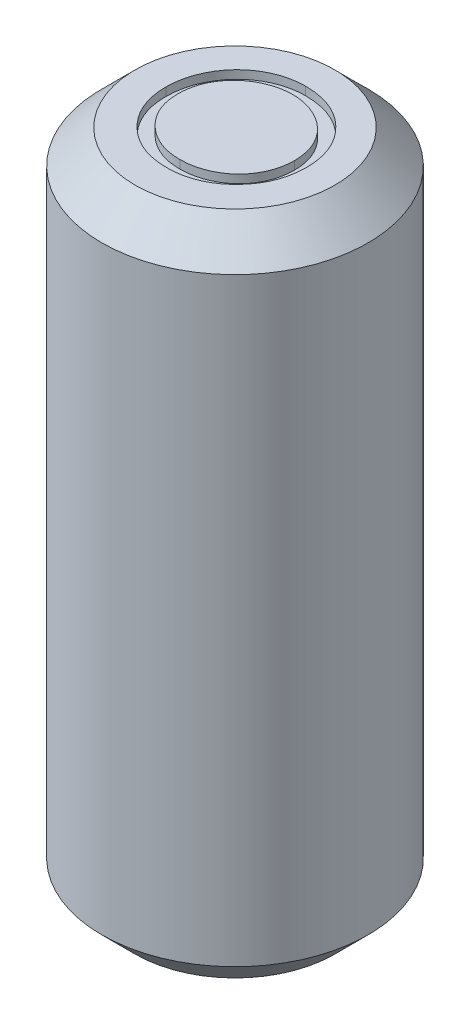
ISO-10303-21;
HEADER;
FILE_DESCRIPTION(('STEP AP214'),'2;1');
FILE_NAME('part.step','',(''),(''),'','','');
FILE_SCHEMA(('AUTOMOTIVE_DESIGN { 1 0 10303 214 1 1 1 1 }'));
ENDSEC;
DATA;
#1=APPLICATION_CONTEXT('core data for automotive mechanical design processes');
#2=APPLICATION_PROTOCOL_DEFINITION('international standard','automotive_design',2000,#1);
#3=PRODUCT_CONTEXT('',#1,'mechanical');
#4=PRODUCT('Part','Part','',(#3));
#5=PRODUCT_RELATED_PRODUCT_CATEGORY('part','',(#4));
#6=PRODUCT_DEFINITION_FORMATION('','',#4);
#7=PRODUCT_DEFINITION_CONTEXT('part definition',#1,'design');
#8=PRODUCT_DEFINITION('design','',#6,#7);
#9=PRODUCT_DEFINITION_SHAPE('','',#8);
#10=(LENGTH_UNIT() NAMED_UNIT(*) SI_UNIT(.MILLI.,.METRE.));
#11=(NAMED_UNIT(*) PLANE_ANGLE_UNIT() SI_UNIT($,.RADIAN.));
#12=(NAMED_UNIT(*) SI_UNIT($,.STERADIAN.) SOLID_ANGLE_UNIT());
#13=UNCERTAINTY_MEASURE_WITH_UNIT(LENGTH_MEASURE(1.E-05),#10,'distance_accuracy_value','');
#14=(GEOMETRIC_REPRESENTATION_CONTEXT(3) GLOBAL_UNCERTAINTY_ASSIGNED_CONTEXT((#13)) GLOBAL_UNIT_ASSIGNED_CONTEXT((#10,
#11,#12)) REPRESENTATION_CONTEXT('',''));
#15=CARTESIAN_POINT('',(0.,0.,0.));
#16=DIRECTION('',(0.,0.,1.));
#17=DIRECTION('',(1.,0.,0.));
#18=AXIS2_PLACEMENT_3D('',#15,#16,#17);
#19=CARTESIAN_POINT('',(0.,20.,0.));
#20=DIRECTION('',(0.,1.,0.));
#21=DIRECTION('',(0.,0.,1.));
#22=AXIS2_PLACEMENT_3D('',#19,#20,#21);
#23=PLANE('',#22);
#24=CARTESIAN_POINT('',(0.,20.,0.));
#25=DIRECTION('',(0.,1.,0.));
#26=DIRECTION('',(0.,0.,1.));
#27=AXIS2_PLACEMENT_3D('',#24,#25,#26);
#28=CIRCLE('',#27,3.);
#29=CARTESIAN_POINT('',(0.,20.,3.));
#30=VERTEX_POINT('',#29);
#31=EDGE_CURVE('E11',#30,#30,#28,.T.);
#32=ORIENTED_EDGE('',*,*,#31,.T.);
#33=EDGE_LOOP('',(#32));
#34=FACE_BOUND('',#33,.T.);
#35=CARTESIAN_POINT('',(0.01653255673133,20.,2.07047889890283));
#36=CARTESIAN_POINT('',(-0.0559523792453316,20.,2.06870817106936));
#37=CARTESIAN_POINT('',(-0.198839483174882,20.,2.06521759515088));
#38=CARTESIAN_POINT('',(-0.408596095037471,20.,2.03529598966283));
#39=CARTESIAN_POINT('',(-0.610056373720643,20.,1.98850592817573));
#40=CARTESIAN_POINT('',(-0.802644203677615,20.,1.92163800106882));
#41=CARTESIAN_POINT('',(-0.986466980361596,20.,1.83521830881186));
#42=CARTESIAN_POINT('',(-1.1618842177268,20.,1.7298418755947));
#43=CARTESIAN_POINT('',(-1.3281918145744,20.,1.60480514281684));
#44=CARTESIAN_POINT('',(-1.48401095341386,20.,1.46290048615286));
#45=CARTESIAN_POINT('',(-1.62658146562237,20.,1.30841871242052));
#46=CARTESIAN_POINT('',(-1.75087789498567,20.,1.14289384947401));
#47=CARTESIAN_POINT('',(-1.85627802449332,20.,0.969573327595772));
#48=CARTESIAN_POINT('',(-1.94240754734506,20.,0.787976157181266));
#49=CARTESIAN_POINT('',(-2.01059550088187,20.,0.598980222664964));
#50=CARTESIAN_POINT('',(-2.05711529304082,20.,0.401324819819868));
#51=CARTESIAN_POINT('',(-2.08721352397665,20.,0.196136813174394));
#52=CARTESIAN_POINT('',(-2.09068191995576,20.,0.056430643659763));
#53=CARTESIAN_POINT('',(-2.09244180224303,20.,-0.0144569985330626));
#54=B_SPLINE_CURVE_WITH_KNOTS('',3,(#35,#36,#37,#38,#39,#40,#41,#42,#43,#44,#45,#46,#47,#48,#49,
#50,#51,#52,#53),.UNSPECIFIED.,.F.,.F.,(4,1,1,1,1,1,1,1,1,1,1,1,1,1,1,1,4),(0.,
0.065818876843307,0.129746526906831,0.192071954488006,0.253459424298202,0.31456958779642,
0.376279881188026,0.43902565366856,0.503267028829086,0.567492822879295,0.629704795605245,
0.690999649215756,0.751451650917447,0.812004364264694,0.873149681068043,0.935635483731786,1.),.UNSPECIFIED.);
#55=CARTESIAN_POINT('',(0.01653255673133,20.,2.07047889890283));
#56=VERTEX_POINT('',#55);
#57=CARTESIAN_POINT('',(-2.09244180224303,20.,-0.0144569985330626));
#58=VERTEX_POINT('',#57);
#59=EDGE_CURVE('E189',#56,#58,#54,.T.);
#60=ORIENTED_EDGE('',*,*,#59,.T.);
#61=CARTESIAN_POINT('',(-2.09244180224303,20.,-0.0144569985330626));
#62=CARTESIAN_POINT('',(-2.09183079023719,20.,-0.0620371918320963));
#63=CARTESIAN_POINT('',(-2.0906164744156,20.,-0.156597332982512));
#64=CARTESIAN_POINT('',(-2.07599739730837,20.,-0.297016304585179));
#65=CARTESIAN_POINT('',(-2.05478402450069,20.,-0.435177056318892));
#66=CARTESIAN_POINT('',(-2.02438183872995,20.,-0.570686711135252));
#67=CARTESIAN_POINT('',(-1.98461993360253,20.,-0.703213550795025));
#68=CARTESIAN_POINT('',(-1.93770333087079,20.,-0.833671565465134));
#69=CARTESIAN_POINT('',(-1.88040065046221,20.,-0.96073867831704));
#70=CARTESIAN_POINT('',(-1.81562276698924,20.,-1.08501684027262));
#71=CARTESIAN_POINT('',(-1.74332355782029,20.,-1.20456873265694));
#72=CARTESIAN_POINT('',(-1.6634655584466,20.,-1.31757397054394));
#73=CARTESIAN_POINT('',(-1.57885370876903,20.,-1.42498082400937));
#74=CARTESIAN_POINT('',(-1.48609554462269,20.,-1.52400597125399));
#75=CARTESIAN_POINT('',(-1.38824817868501,20.,-1.61753014998534));
#76=CARTESIAN_POINT('',(-1.28372431796018,20.,-1.70411611229417));
#77=CARTESIAN_POINT('',(-1.17316175297097,20.,-1.78454462767307));
#78=CARTESIAN_POINT('',(-1.05608474752459,20.,-1.85702501747929));
#79=CARTESIAN_POINT('',(-0.935378147662237,20.,-1.9225783141831));
#80=CARTESIAN_POINT('',(-0.810947544485812,20.,-1.97883185816338));
#81=CARTESIAN_POINT('',(-0.6844828913365,20.,-2.02711307131828));
#82=CARTESIAN_POINT('',(-0.555391865135941,20.,-2.06624544297203));
#83=CARTESIAN_POINT('',(-0.424017268472697,20.,-2.09713919839147));
#84=CARTESIAN_POINT('',(-0.290072371817983,20.,-2.11817617405872));
#85=CARTESIAN_POINT('',(-0.153663884641482,20.,-2.1328325373587));
#86=CARTESIAN_POINT('',(-0.0617652344129273,20.,-2.13404111106077));
#87=CARTESIAN_POINT('',(-0.0155187253199521,20.,-2.13464930622537));
#88=B_SPLINE_CURVE_WITH_KNOTS('',3,(#61,#62,#63,#64,#65,#66,#67,#68,#69,#70,#71,#72,#73,#74,#75,
#76,#77,#78,#79,#80,#81,#82,#83,#84,#85,#86,#87),.UNSPECIFIED.,.F.,.F.,(4,1,1,1,1,1,1,1,1,1,1,1,
1,1,1,1,1,1,1,1,1,1,1,1,4),(0.,0.0432089861713366,0.0858728716306187,0.128120006696703,
0.170151964454199,0.211917620987861,0.253753002619124,0.296006408855951,0.338443357144784,
0.381015368162034,0.422820479440761,0.464089055794313,0.505125848683686,0.545974970685241,
0.58698521113386,0.628338591634663,0.670083801591206,0.711991602363722,0.753039154863019,
0.794049395311638,0.834885542701582,0.875498312929513,0.916547299830379,0.958003778644961,1.),.UNSPECIFIED.);
#89=CARTESIAN_POINT('',(-0.0155187253199521,20.,-2.13464930622537));
#90=VERTEX_POINT('',#89);
#91=EDGE_CURVE('E48',#58,#90,#88,.T.);
#92=ORIENTED_EDGE('',*,*,#91,.T.);
#93=CARTESIAN_POINT('',(-0.0155187253199521,20.,-2.13464930622537));
#94=CARTESIAN_POINT('',(0.058547681432086,20.,-2.1327733298013));
#95=CARTESIAN_POINT('',(0.204020215096148,20.,-2.12908875732814));
#96=CARTESIAN_POINT('',(0.41782009820927,20.,-2.10088406755058));
#97=CARTESIAN_POINT('',(0.621928778534491,20.,-2.05208933615963));
#98=CARTESIAN_POINT('',(0.818008937165094,20.,-1.98710307046737));
#99=CARTESIAN_POINT('',(1.00371519610132,20.,-1.90041234431791));
#100=CARTESIAN_POINT('',(1.18044535894771,20.,-1.79562931764418));
#101=CARTESIAN_POINT('',(1.34777892903407,20.,-1.67165622192044));
#102=CARTESIAN_POINT('',(1.50346050792369,20.,-1.5294513912329));
#103=CARTESIAN_POINT('',(1.64592559396163,20.,-1.37472744391682));
#104=CARTESIAN_POINT('',(1.7714408925551,20.,-1.20960983240491));
#105=CARTESIAN_POINT('',(1.87663208539134,20.,-1.035096915483));
#106=CARTESIAN_POINT('',(1.96301584215162,20.,-0.851713109035313));
#107=CARTESIAN_POINT('',(2.03078568180171,20.,-0.659873145635723));
#108=CARTESIAN_POINT('',(2.0775503031624,20.,-0.458554285359863));
#109=CARTESIAN_POINT('',(2.10742247476575,20.,-0.249060925277516));
#110=CARTESIAN_POINT('',(2.11091479180284,20.,-0.106173079878947));
#111=CARTESIAN_POINT('',(2.11268640288518,20.,-0.0336877677638322));
#112=B_SPLINE_CURVE_WITH_KNOTS('',3,(#93,#94,#95,#96,#97,#98,#99,#100,#101,#102,#103,#104,#105,
#106,#107,#108,#109,#110,#111),.UNSPECIFIED.,.F.,.F.,(4,1,1,1,1,1,1,1,1,1,1,1,1,1,1,1,4),(0.,
0.0665700352151801,0.130749041482178,0.193412800029504,0.254989398889709,0.3161135558759,
0.377261757908984,0.439400784155553,0.502970589371976,0.566524976360731,0.628231102513309,
0.689090610599863,0.749344668995804,0.810169593372207,0.871609824317044,0.934869184072764,1.),.UNSPECIFIED.);
#113=CARTESIAN_POINT('',(2.11268640288518,20.,-0.0336877677638322));
#114=VERTEX_POINT('',#113);
#115=EDGE_CURVE('E173',#90,#114,#112,.T.);
#116=ORIENTED_EDGE('',*,*,#115,.T.);
#117=CARTESIAN_POINT('',(2.11268640288518,20.,-0.0336877677638322));
#118=CARTESIAN_POINT('',(2.11091505142908,20.,0.0382635995008125));
#119=CARTESIAN_POINT('',(2.10742351249683,20.,0.180088079994498));
#120=CARTESIAN_POINT('',(2.0775163381705,20.,0.388252016189601));
#121=CARTESIAN_POINT('',(2.03061233820019,20.,0.588355669312141));
#122=CARTESIAN_POINT('',(1.96364517684864,20.,0.780064986769198));
#123=CARTESIAN_POINT('',(1.87767320146202,20.,0.963582202500641));
#124=CARTESIAN_POINT('',(1.77178157731237,20.,1.13842443550847));
#125=CARTESIAN_POINT('',(1.64704876503564,20.,1.30464900509238));
#126=CARTESIAN_POINT('',(1.50509807814042,20.,1.46043490820515));
#127=CARTESIAN_POINT('',(1.35035403012436,20.,1.60328916042642));
#128=CARTESIAN_POINT('',(1.1843765823427,20.,1.72776787549347));
#129=CARTESIAN_POINT('',(1.01089850243181,20.,1.83488116074934));
#130=CARTESIAN_POINT('',(0.827687407392546,20.,1.92034821670962));
#131=CARTESIAN_POINT('',(0.637173079590893,20.,1.98865898293256));
#132=CARTESIAN_POINT('',(0.437650424632607,20.,2.03523341725414));
#133=CARTESIAN_POINT('',(0.23005436287216,20.,2.06527575239936));
#134=CARTESIAN_POINT('',(0.0884875013834962,20.,2.06872548492868));
#135=CARTESIAN_POINT('',(0.01653255673133,20.,2.07047889890283));
#136=B_SPLINE_CURVE_WITH_KNOTS('',3,(#117,#118,#119,#120,#121,#122,#123,#124,#125,#126,#127,
#128,#129,#130,#131,#132,#133,#134,#135),.UNSPECIFIED.,.F.,.F.,(4,1,1,1,1,1,1,1,1,1,1,1,1,1,1,1,
4),(0.,0.0652265038922758,0.128568995706729,0.190320378104467,0.251377988624063,
0.312387528333694,0.373788704276724,0.43643115978045,0.500566755309854,0.564686795384744,
0.627135517883514,0.68845540889498,0.749245746463747,0.810155177364678,0.871670925652923,
0.934773496107724,1.),.UNSPECIFIED.);
#137=EDGE_CURVE('E181',#114,#56,#136,.T.);
#138=ORIENTED_EDGE('',*,*,#137,.T.);
#139=EDGE_LOOP('',(#60,#92,#116,#138));
#140=FACE_BOUND('',#139,.T.);
#141=ADVANCED_FACE('F33',(#34,#140),#23,.T.);
#142=CARTESIAN_POINT('',(0.,20.,0.));
#143=DIRECTION('',(0.,-1.,0.));
#144=DIRECTION('',(0.,0.,-1.));
#145=AXIS2_PLACEMENT_3D('',#142,#143,#144);
#146=CYLINDRICAL_SURFACE('',#145,4.);
#147=CARTESIAN_POINT('',(0.,1.,0.));
#148=DIRECTION('',(0.,1.,0.));
#149=DIRECTION('',(0.,0.,1.));
#150=AXIS2_PLACEMENT_3D('',#147,#148,#149);
#151=CIRCLE('',#150,4.);
#152=CARTESIAN_POINT('',(0.,1.,4.));
#153=VERTEX_POINT('',#152);
#154=EDGE_CURVE('E211',#153,#153,#151,.T.);
#155=ORIENTED_EDGE('',*,*,#154,.T.);
#156=EDGE_LOOP('',(#155));
#157=FACE_BOUND('',#156,.T.);
#158=CARTESIAN_POINT('',(0.,19.,0.));
#159=DIRECTION('',(0.,1.,0.));
#160=DIRECTION('',(0.,0.,1.));
#161=AXIS2_PLACEMENT_3D('',#158,#159,#160);
#162=CIRCLE('',#161,4.);
#163=CARTESIAN_POINT('',(0.,19.,4.));
#164=VERTEX_POINT('',#163);
#165=EDGE_CURVE('E208',#164,#164,#162,.F.);
#166=ORIENTED_EDGE('',*,*,#165,.T.);
#167=EDGE_LOOP('',(#166));
#168=FACE_BOUND('',#167,.T.);
#169=ADVANCED_FACE('F223',(#157,#168),#146,.T.);
#170=CARTESIAN_POINT('',(0.,0.,0.));
#171=DIRECTION('',(0.,1.,0.));
#172=DIRECTION('',(0.,0.,1.));
#173=AXIS2_PLACEMENT_3D('',#170,#171,#172);
#174=PLANE('',#173);
#175=CARTESIAN_POINT('',(0.,0.,0.));
#176=DIRECTION('',(0.,1.,0.));
#177=DIRECTION('',(0.,0.,1.));
#178=AXIS2_PLACEMENT_3D('',#175,#176,#177);
#179=CIRCLE('',#178,2.99999999999999);
#180=CARTESIAN_POINT('',(0.,0.,2.99999999999999));
#181=VERTEX_POINT('',#180);
#182=EDGE_CURVE('E41',#181,#181,#179,.F.);
#183=ORIENTED_EDGE('',*,*,#182,.T.);
#184=EDGE_LOOP('',(#183));
#185=FACE_BOUND('',#184,.T.);
#186=ADVANCED_FACE('F216',(#185),#174,.F.);
#187=CARTESIAN_POINT('',(0.,1.,0.));
#188=DIRECTION('',(0.,1.,0.));
#189=DIRECTION('',(0.,0.,1.));
#190=AXIS2_PLACEMENT_3D('',#187,#188,#189);
#191=CONICAL_SURFACE('',#190,4.,0.785398163397452);
#192=ORIENTED_EDGE('',*,*,#182,.F.);
#193=EDGE_LOOP('',(#192));
#194=FACE_BOUND('',#193,.T.);
#195=ORIENTED_EDGE('',*,*,#154,.F.);
#196=EDGE_LOOP('',(#195));
#197=FACE_BOUND('',#196,.T.);
#198=ADVANCED_FACE('F218',(#194,#197),#191,.T.);
#199=CARTESIAN_POINT('',(0.,20.,0.));
#200=DIRECTION('',(0.,-1.,0.));
#201=DIRECTION('',(0.,0.,-1.));
#202=AXIS2_PLACEMENT_3D('',#199,#200,#201);
#203=CONICAL_SURFACE('',#202,3.,0.785398163397447);
#204=ORIENTED_EDGE('',*,*,#165,.F.);
#205=EDGE_LOOP('',(#204));
#206=FACE_BOUND('',#205,.T.);
#207=ORIENTED_EDGE('',*,*,#31,.F.);
#208=EDGE_LOOP('',(#207));
#209=FACE_BOUND('',#208,.T.);
#210=ADVANCED_FACE('F35',(#206,#209),#203,.T.);
#211=CARTESIAN_POINT('',(-2.09244180224303,19.75,-0.0144569985330626));
#212=CARTESIAN_POINT('',(-2.09183079023719,19.75,-0.0620371918320963));
#213=CARTESIAN_POINT('',(-2.0906164744156,19.75,-0.156597332982512));
#214=CARTESIAN_POINT('',(-2.07599739730837,19.75,-0.297016304585179));
#215=CARTESIAN_POINT('',(-2.05478402450069,19.75,-0.435177056318892));
#216=CARTESIAN_POINT('',(-2.02438183872995,19.75,-0.570686711135252));
#217=CARTESIAN_POINT('',(-1.98461993360253,19.75,-0.703213550795025));
#218=CARTESIAN_POINT('',(-1.93770333087079,19.75,-0.833671565465134));
#219=CARTESIAN_POINT('',(-1.88040065046221,19.75,-0.96073867831704));
#220=CARTESIAN_POINT('',(-1.81562276698924,19.75,-1.08501684027262));
#221=CARTESIAN_POINT('',(-1.74332355782029,19.75,-1.20456873265694));
#222=CARTESIAN_POINT('',(-1.6634655584466,19.75,-1.31757397054394));
#223=CARTESIAN_POINT('',(-1.57885370876903,19.75,-1.42498082400937));
#224=CARTESIAN_POINT('',(-1.48609554462269,19.75,-1.52400597125399));
#225=CARTESIAN_POINT('',(-1.38824817868501,19.75,-1.61753014998534));
#226=CARTESIAN_POINT('',(-1.28372431796018,19.75,-1.70411611229417));
#227=CARTESIAN_POINT('',(-1.17316175297097,19.75,-1.78454462767307));
#228=CARTESIAN_POINT('',(-1.05608474752459,19.75,-1.85702501747929));
#229=CARTESIAN_POINT('',(-0.935378147662237,19.75,-1.9225783141831));
#230=CARTESIAN_POINT('',(-0.810947544485812,19.75,-1.97883185816338));
#231=CARTESIAN_POINT('',(-0.6844828913365,19.75,-2.02711307131828));
#232=CARTESIAN_POINT('',(-0.555391865135941,19.75,-2.06624544297203));
#233=CARTESIAN_POINT('',(-0.424017268472697,19.75,-2.09713919839147));
#234=CARTESIAN_POINT('',(-0.290072371817983,19.75,-2.11817617405872));
#235=CARTESIAN_POINT('',(-0.153663884641482,19.75,-2.1328325373587));
#236=CARTESIAN_POINT('',(-0.0617652344129273,19.75,-2.13404111106077));
#237=CARTESIAN_POINT('',(-0.0155187253199521,19.75,-2.13464930622537));
#238=B_SPLINE_CURVE_WITH_KNOTS('',3,(#211,#212,#213,#214,#215,#216,#217,#218,#219,#220,#221,
#222,#223,#224,#225,#226,#227,#228,#229,#230,#231,#232,#233,#234,#235,#236,#237),.UNSPECIFIED.,
.F.,.F.,(4,1,1,1,1,1,1,1,1,1,1,1,1,1,1,1,1,1,1,1,1,1,1,1,4),(0.,0.0432089861713366,
0.0858728716306187,0.128120006696703,0.170151964454199,0.211917620987861,0.253753002619124,
0.296006408855951,0.338443357144784,0.381015368162034,0.422820479440761,0.464089055794313,
0.505125848683686,0.545974970685241,0.58698521113386,0.628338591634663,0.670083801591206,
0.711991602363722,0.753039154863019,0.794049395311638,0.834885542701582,0.875498312929513,
0.916547299830379,0.958003778644961,1.),.UNSPECIFIED.);
#239=DIRECTION('',(0.,1.,0.));
#240=VECTOR('',#239,1.);
#241=SURFACE_OF_LINEAR_EXTRUSION('',#238,#240);
#242=ORIENTED_EDGE('',*,*,#91,.F.);
#243=DIRECTION('',(0.,1.,0.));
#244=VECTOR('',#243,1.);
#245=CARTESIAN_POINT('',(-2.09244180224303,19.75,-0.0144569985330626));
#246=LINE('',#245,#244);
#247=CARTESIAN_POINT('',(-2.09244180224303,19.75,-0.0144569985330626));
#248=VERTEX_POINT('',#247);
#249=EDGE_CURVE('E161',#248,#58,#246,.T.);
#250=ORIENTED_EDGE('',*,*,#249,.F.);
#251=CARTESIAN_POINT('',(-0.0155187253199521,19.75,-2.13464930622537));
#252=VERTEX_POINT('',#251);
#253=EDGE_CURVE('E197',#248,#252,#238,.T.);
#254=ORIENTED_EDGE('',*,*,#253,.T.);
#255=DIRECTION('',(0.,1.,0.));
#256=VECTOR('',#255,1.);
#257=CARTESIAN_POINT('',(-0.0155187253199521,19.75,-2.13464930622537));
#258=LINE('',#257,#256);
#259=EDGE_CURVE('E206',#252,#90,#258,.T.);
#260=ORIENTED_EDGE('',*,*,#259,.T.);
#261=EDGE_LOOP('',(#242,#250,#254,#260));
#262=FACE_BOUND('',#261,.T.);
#263=ADVANCED_FACE('F231',(#262),#241,.T.);
#264=CARTESIAN_POINT('',(-0.0155187253199521,19.75,-2.13464930622537));
#265=CARTESIAN_POINT('',(0.058547681432086,19.75,-2.1327733298013));
#266=CARTESIAN_POINT('',(0.204020215096148,19.75,-2.12908875732814));
#267=CARTESIAN_POINT('',(0.41782009820927,19.75,-2.10088406755058));
#268=CARTESIAN_POINT('',(0.621928778534491,19.75,-2.05208933615963));
#269=CARTESIAN_POINT('',(0.818008937165094,19.75,-1.98710307046737));
#270=CARTESIAN_POINT('',(1.00371519610132,19.75,-1.90041234431791));
#271=CARTESIAN_POINT('',(1.18044535894771,19.75,-1.79562931764418));
#272=CARTESIAN_POINT('',(1.34777892903407,19.75,-1.67165622192044));
#273=CARTESIAN_POINT('',(1.50346050792369,19.75,-1.5294513912329));
#274=CARTESIAN_POINT('',(1.64592559396163,19.75,-1.37472744391682));
#275=CARTESIAN_POINT('',(1.7714408925551,19.75,-1.20960983240491));
#276=CARTESIAN_POINT('',(1.87663208539134,19.75,-1.035096915483));
#277=CARTESIAN_POINT('',(1.96301584215162,19.75,-0.851713109035313));
#278=CARTESIAN_POINT('',(2.03078568180171,19.75,-0.659873145635723));
#279=CARTESIAN_POINT('',(2.0775503031624,19.75,-0.458554285359863));
#280=CARTESIAN_POINT('',(2.10742247476575,19.75,-0.249060925277516));
#281=CARTESIAN_POINT('',(2.11091479180284,19.75,-0.106173079878947));
#282=CARTESIAN_POINT('',(2.11268640288518,19.75,-0.0336877677638322));
#283=B_SPLINE_CURVE_WITH_KNOTS('',3,(#264,#265,#266,#267,#268,#269,#270,#271,#272,#273,#274,
#275,#276,#277,#278,#279,#280,#281,#282),.UNSPECIFIED.,.F.,.F.,(4,1,1,1,1,1,1,1,1,1,1,1,1,1,1,1,
4),(0.,0.0665700352151801,0.130749041482178,0.193412800029504,0.254989398889709,0.3161135558759,
0.377261757908984,0.439400784155553,0.502970589371976,0.566524976360731,0.628231102513309,
0.689090610599863,0.749344668995804,0.810169593372207,0.871609824317044,0.934869184072764,1.),.UNSPECIFIED.);
#284=DIRECTION('',(0.,1.,0.));
#285=VECTOR('',#284,1.);
#286=SURFACE_OF_LINEAR_EXTRUSION('',#283,#285);
#287=ORIENTED_EDGE('',*,*,#115,.F.);
#288=ORIENTED_EDGE('',*,*,#259,.F.);
#289=CARTESIAN_POINT('',(2.11268640288518,19.75,-0.0336877677638322));
#290=VERTEX_POINT('',#289);
#291=EDGE_CURVE('E246',#252,#290,#283,.T.);
#292=ORIENTED_EDGE('',*,*,#291,.T.);
#293=DIRECTION('',(0.,1.,0.));
#294=VECTOR('',#293,1.);
#295=CARTESIAN_POINT('',(2.11268640288518,19.75,-0.0336877677638322));
#296=LINE('',#295,#294);
#297=EDGE_CURVE('E204',#290,#114,#296,.T.);
#298=ORIENTED_EDGE('',*,*,#297,.T.);
#299=EDGE_LOOP('',(#287,#288,#292,#298));
#300=FACE_BOUND('',#299,.T.);
#301=ADVANCED_FACE('F260',(#300),#286,.T.);
#302=CARTESIAN_POINT('',(2.11268640288518,19.75,-0.0336877677638322));
#303=CARTESIAN_POINT('',(2.11091505142908,19.75,0.0382635995008125));
#304=CARTESIAN_POINT('',(2.10742351249683,19.75,0.180088079994498));
#305=CARTESIAN_POINT('',(2.0775163381705,19.75,0.388252016189601));
#306=CARTESIAN_POINT('',(2.03061233820019,19.75,0.588355669312141));
#307=CARTESIAN_POINT('',(1.96364517684864,19.75,0.780064986769198));
#308=CARTESIAN_POINT('',(1.87767320146202,19.75,0.963582202500641));
#309=CARTESIAN_POINT('',(1.77178157731237,19.75,1.13842443550847));
#310=CARTESIAN_POINT('',(1.64704876503564,19.75,1.30464900509238));
#311=CARTESIAN_POINT('',(1.50509807814042,19.75,1.46043490820515));
#312=CARTESIAN_POINT('',(1.35035403012436,19.75,1.60328916042642));
#313=CARTESIAN_POINT('',(1.1843765823427,19.75,1.72776787549347));
#314=CARTESIAN_POINT('',(1.01089850243181,19.75,1.83488116074934));
#315=CARTESIAN_POINT('',(0.827687407392546,19.75,1.92034821670962));
#316=CARTESIAN_POINT('',(0.637173079590893,19.75,1.98865898293256));
#317=CARTESIAN_POINT('',(0.437650424632607,19.75,2.03523341725414));
#318=CARTESIAN_POINT('',(0.23005436287216,19.75,2.06527575239936));
#319=CARTESIAN_POINT('',(0.0884875013834962,19.75,2.06872548492868));
#320=CARTESIAN_POINT('',(0.01653255673133,19.75,2.07047889890283));
#321=B_SPLINE_CURVE_WITH_KNOTS('',3,(#302,#303,#304,#305,#306,#307,#308,#309,#310,#311,#312,
#313,#314,#315,#316,#317,#318,#319,#320),.UNSPECIFIED.,.F.,.F.,(4,1,1,1,1,1,1,1,1,1,1,1,1,1,1,1,
4),(0.,0.0652265038922758,0.128568995706729,0.190320378104467,0.251377988624063,
0.312387528333694,0.373788704276724,0.43643115978045,0.500566755309854,0.564686795384744,
0.627135517883514,0.68845540889498,0.749245746463747,0.810155177364678,0.871670925652923,
0.934773496107724,1.),.UNSPECIFIED.);
#322=DIRECTION('',(0.,1.,0.));
#323=VECTOR('',#322,1.);
#324=SURFACE_OF_LINEAR_EXTRUSION('',#321,#323);
#325=ORIENTED_EDGE('',*,*,#137,.F.);
#326=ORIENTED_EDGE('',*,*,#297,.F.);
#327=CARTESIAN_POINT('',(0.01653255673133,19.75,2.07047889890283));
#328=VERTEX_POINT('',#327);
#329=EDGE_CURVE('E162',#290,#328,#321,.T.);
#330=ORIENTED_EDGE('',*,*,#329,.T.);
#331=DIRECTION('',(0.,1.,0.));
#332=VECTOR('',#331,1.);
#333=CARTESIAN_POINT('',(0.01653255673133,19.75,2.07047889890283));
#334=LINE('',#333,#332);
#335=EDGE_CURVE('E202',#328,#56,#334,.T.);
#336=ORIENTED_EDGE('',*,*,#335,.T.);
#337=EDGE_LOOP('',(#325,#326,#330,#336));
#338=FACE_BOUND('',#337,.T.);
#339=ADVANCED_FACE('F152',(#338),#324,.T.);
#340=CARTESIAN_POINT('',(0.01653255673133,19.75,2.07047889890283));
#341=CARTESIAN_POINT('',(-0.0559523792453316,19.75,2.06870817106936));
#342=CARTESIAN_POINT('',(-0.198839483174882,19.75,2.06521759515088));
#343=CARTESIAN_POINT('',(-0.408596095037471,19.75,2.03529598966283));
#344=CARTESIAN_POINT('',(-0.610056373720643,19.75,1.98850592817573));
#345=CARTESIAN_POINT('',(-0.802644203677615,19.75,1.92163800106882));
#346=CARTESIAN_POINT('',(-0.986466980361596,19.75,1.83521830881186));
#347=CARTESIAN_POINT('',(-1.1618842177268,19.75,1.7298418755947));
#348=CARTESIAN_POINT('',(-1.3281918145744,19.75,1.60480514281684));
#349=CARTESIAN_POINT('',(-1.48401095341386,19.75,1.46290048615286));
#350=CARTESIAN_POINT('',(-1.62658146562237,19.75,1.30841871242052));
#351=CARTESIAN_POINT('',(-1.75087789498567,19.75,1.14289384947401));
#352=CARTESIAN_POINT('',(-1.85627802449332,19.75,0.969573327595772));
#353=CARTESIAN_POINT('',(-1.94240754734506,19.75,0.787976157181266));
#354=CARTESIAN_POINT('',(-2.01059550088187,19.75,0.598980222664964));
#355=CARTESIAN_POINT('',(-2.05711529304082,19.75,0.401324819819868));
#356=CARTESIAN_POINT('',(-2.08721352397665,19.75,0.196136813174394));
#357=CARTESIAN_POINT('',(-2.09068191995576,19.75,0.056430643659763));
#358=CARTESIAN_POINT('',(-2.09244180224303,19.75,-0.0144569985330626));
#359=B_SPLINE_CURVE_WITH_KNOTS('',3,(#340,#341,#342,#343,#344,#345,#346,#347,#348,#349,#350,
#351,#352,#353,#354,#355,#356,#357,#358),.UNSPECIFIED.,.F.,.F.,(4,1,1,1,1,1,1,1,1,1,1,1,1,1,1,1,
4),(0.,0.065818876843307,0.129746526906831,0.192071954488006,0.253459424298202,0.31456958779642,
0.376279881188026,0.43902565366856,0.503267028829086,0.567492822879295,0.629704795605245,
0.690999649215756,0.751451650917447,0.812004364264694,0.873149681068043,0.935635483731786,1.),.UNSPECIFIED.);
#360=DIRECTION('',(0.,1.,0.));
#361=VECTOR('',#360,1.);
#362=SURFACE_OF_LINEAR_EXTRUSION('',#359,#361);
#363=ORIENTED_EDGE('',*,*,#59,.F.);
#364=ORIENTED_EDGE('',*,*,#335,.F.);
#365=EDGE_CURVE('E156',#328,#248,#359,.T.);
#366=ORIENTED_EDGE('',*,*,#365,.T.);
#367=ORIENTED_EDGE('',*,*,#249,.T.);
#368=EDGE_LOOP('',(#363,#364,#366,#367));
#369=FACE_BOUND('',#368,.T.);
#370=ADVANCED_FACE('F148',(#369),#362,.T.);
#371=CARTESIAN_POINT('',(-1.49694096678966,19.75,-1.51119618005103));
#372=DIRECTION('',(1.87838221541554E-12,1.,0.));
#373=DIRECTION('',(-1.,1.87838221541554E-12,0.));
#374=AXIS2_PLACEMENT_3D('',#371,#372,#373);
#375=PLANE('',#374);
#376=CARTESIAN_POINT('',(0.00210947980825316,19.75,1.66022248864642));
#377=CARTESIAN_POINT('',(0.041663195936486,19.75,1.65967905508508));
#378=CARTESIAN_POINT('',(0.120110094650251,19.75,1.65860126311716));
#379=CARTESIAN_POINT('',(0.236790691624863,19.75,1.64774563244647));
#380=CARTESIAN_POINT('',(0.351369219317382,19.75,1.63033778168286));
#381=CARTESIAN_POINT('',(0.463684967751986,19.75,1.60527417527274));
#382=CARTESIAN_POINT('',(0.573610466479381,19.75,1.57390593935494));
#383=CARTESIAN_POINT('',(0.681604527182177,19.75,1.53663996454456));
#384=CARTESIAN_POINT('',(0.786516858975931,19.75,1.49014716033525));
#385=CARTESIAN_POINT('',(0.889670959320133,19.75,1.43877807281637));
#386=CARTESIAN_POINT('',(0.988409521252895,19.75,1.38021789277823));
#387=CARTESIAN_POINT('',(1.08266727244242,19.75,1.31731715031045));
#388=CARTESIAN_POINT('',(1.17006839227656,19.75,1.24763872664208));
#389=CARTESIAN_POINT('',(1.25279875961478,19.75,1.17413265516321));
#390=CARTESIAN_POINT('',(1.33008754703487,19.75,1.0953168290407));
#391=CARTESIAN_POINT('',(1.40141210043506,19.75,1.01129371835853));
#392=CARTESIAN_POINT('',(1.4665322514638,19.75,0.921532967234924));
#393=CARTESIAN_POINT('',(1.52649299044552,19.75,0.827492503531747));
#394=CARTESIAN_POINT('',(1.57998243359501,19.75,0.72921107189151));
#395=CARTESIAN_POINT('',(1.62658711822256,19.75,0.628034297093361));
#396=CARTESIAN_POINT('',(1.6661255363171,19.75,0.52421131496));
#397=CARTESIAN_POINT('',(1.69804382755054,19.75,0.41759237612415));
#398=CARTESIAN_POINT('',(1.72305578375987,19.75,0.308379977528908));
#399=CARTESIAN_POINT('',(1.74028997794041,19.75,0.196427888201652));
#400=CARTESIAN_POINT('',(1.75234533639412,19.75,0.0819600682129593));
#401=CARTESIAN_POINT('',(1.75325399603604,19.75,0.00453851854241332));
#402=CARTESIAN_POINT('',(1.75371204391082,19.75,-0.0344890498151142));
#403=B_SPLINE_CURVE_WITH_KNOTS('',3,(#376,#377,#378,#379,#380,#381,#382,#383,#384,#385,#386,
#387,#388,#389,#390,#391,#392,#393,#394,#395,#396,#397,#398,#399,#400,#401,#402),.UNSPECIFIED.,
.F.,.F.,(4,1,1,1,1,1,1,1,1,1,1,1,1,1,1,1,1,1,1,1,1,1,1,1,4),(0.,0.0436332182657581,
0.0865377766972012,0.129177336089892,0.171436323663829,0.213415894570908,0.25526595455385,
0.297369481156624,0.339940747898555,0.382347458751812,0.423952946815271,0.464871163261017,
0.505572294118273,0.546002577108316,0.586567974806913,0.627064799148168,0.668270684033174,
0.709549224850334,0.750428153513189,0.791096194448593,0.832027144779434,0.873135955335967,
0.914610764365449,0.956955986480437,1.),.UNSPECIFIED.);
#404=CARTESIAN_POINT('',(0.00210947980825316,19.75,1.66022248864642));
#405=VERTEX_POINT('',#404);
#406=CARTESIAN_POINT('',(1.75371204391082,19.75,-0.0344890498151142));
#407=VERTEX_POINT('',#406);
#408=EDGE_CURVE('E112',#405,#407,#403,.T.);
#409=ORIENTED_EDGE('',*,*,#408,.F.);
#410=CARTESIAN_POINT('',(-1.73346744326867,19.75,-0.016059562635627));
#411=CARTESIAN_POINT('',(-1.73201045817434,19.75,0.0417258325678136));
#412=CARTESIAN_POINT('',(-1.72914411776052,19.75,0.155407581436735));
#413=CARTESIAN_POINT('',(-1.70404975191445,19.75,0.321999745876667));
#414=CARTESIAN_POINT('',(-1.6653960668255,19.75,0.482100644555511));
#415=CARTESIAN_POINT('',(-1.60841621946926,19.75,0.634834255176675));
#416=CARTESIAN_POINT('',(-1.53715837414624,19.75,0.781513435555613));
#417=CARTESIAN_POINT('',(-1.44912764240375,19.75,0.920836983769828));
#418=CARTESIAN_POINT('',(-1.34483154461058,19.75,1.05284255447118));
#419=CARTESIAN_POINT('',(-1.22635894277994,19.75,1.17660857615087));
#420=CARTESIAN_POINT('',(-1.0968472780947,19.75,1.28957520956746));
#421=CARTESIAN_POINT('',(-0.959324158175864,19.75,1.38873339087613));
#422=CARTESIAN_POINT('',(-0.815262892476098,19.75,1.47263081924584));
#423=CARTESIAN_POINT('',(-0.664287803661834,19.75,1.54097947339827));
#424=CARTESIAN_POINT('',(-0.507204901914026,19.75,1.59513917373999));
#425=CARTESIAN_POINT('',(-0.343001986442666,19.75,1.63225760931432));
#426=CARTESIAN_POINT('',(-0.172772889775677,19.75,1.65668670116334));
#427=CARTESIAN_POINT('',(-0.0567378553069873,19.75,1.65903270793034));
#428=CARTESIAN_POINT('',(0.00210947980825316,19.75,1.66022248864642));
#429=B_SPLINE_CURVE_WITH_KNOTS('',3,(#410,#411,#412,#413,#414,#415,#416,#417,#418,#419,#420,
#421,#422,#423,#424,#425,#426,#427,#428),.UNSPECIFIED.,.F.,.F.,(4,1,1,1,1,1,1,1,1,1,1,1,1,1,1,1,
4),(0.,0.0645039992970557,0.12689932159004,0.187746540100012,0.248149732929826,
0.308586064762742,0.369583005086994,0.431826965381049,0.496179722524157,0.560667854611879,
0.623504455117664,0.685260411330427,0.746536821751167,0.808327351736708,0.870486187887767,
0.934316883359246,1.),.UNSPECIFIED.);
#430=CARTESIAN_POINT('',(-1.73346744326867,19.75,-0.016059562635627));
#431=VERTEX_POINT('',#430);
#432=EDGE_CURVE('E122',#431,#405,#429,.T.);
#433=ORIENTED_EDGE('',*,*,#432,.F.);
#434=CARTESIAN_POINT('',(0.00210947980825316,19.75,-1.72439289596896));
#435=CARTESIAN_POINT('',(-0.0358501013875746,19.75,-1.72393016425097));
#436=CARTESIAN_POINT('',(-0.111406367597373,19.75,-1.72300912456173));
#437=CARTESIAN_POINT('',(-0.223731551879368,19.75,-1.71087687819356));
#438=CARTESIAN_POINT('',(-0.334579476257435,19.75,-1.69358557651201));
#439=CARTESIAN_POINT('',(-0.443973033025002,19.75,-1.66892098135254));
#440=CARTESIAN_POINT('',(-0.551454506599638,19.75,-1.63531634961126));
#441=CARTESIAN_POINT('',(-0.6580257536546,19.75,-1.59664102596622));
#442=CARTESIAN_POINT('',(-0.762714958076024,19.75,-1.54953120814288));
#443=CARTESIAN_POINT('',(-0.865176509911858,19.75,-1.49630526029185));
#444=CARTESIAN_POINT('',(-0.964508024364422,19.75,-1.43739220794471));
#445=CARTESIAN_POINT('',(-1.05823682602701,19.75,-1.37228161704745));
#446=CARTESIAN_POINT('',(-1.14660556198558,19.75,-1.3025004121934));
#447=CARTESIAN_POINT('',(-1.22939786673154,19.75,-1.22788574090503));
#448=CARTESIAN_POINT('',(-1.30637063493097,19.75,-1.14805762457227));
#449=CARTESIAN_POINT('',(-1.3790388651627,19.75,-1.06422626900915));
#450=CARTESIAN_POINT('',(-1.44448981561536,19.75,-0.973995536387835));
#451=CARTESIAN_POINT('',(-1.50447333198896,19.75,-0.879812214254251));
#452=CARTESIAN_POINT('',(-1.55815086373452,19.75,-0.781798978590492));
#453=CARTESIAN_POINT('',(-1.60588269770309,19.75,-0.680987707427155));
#454=CARTESIAN_POINT('',(-1.64492727919509,19.75,-0.57655606539472));
#455=CARTESIAN_POINT('',(-1.67676999494843,19.75,-0.469637028164722));
#456=CARTESIAN_POINT('',(-1.70316977877329,19.75,-0.360399931406464));
#457=CARTESIAN_POINT('',(-1.71989426345253,19.75,-0.248016104161638));
#458=CARTESIAN_POINT('',(-1.73215981710813,19.75,-0.133050261842069));
#459=CARTESIAN_POINT('',(-1.73302821191109,19.75,-0.0553567143652857));
#460=CARTESIAN_POINT('',(-1.73346744326867,19.75,-0.016059562635627));
#461=B_SPLINE_CURVE_WITH_KNOTS('',3,(#434,#435,#436,#437,#438,#439,#440,#441,#442,#443,#444,
#445,#446,#447,#448,#449,#450,#451,#452,#453,#454,#455,#456,#457,#458,#459,#460),.UNSPECIFIED.,
.F.,.F.,(4,1,1,1,1,1,1,1,1,1,1,1,1,1,1,1,1,1,1,1,1,1,1,1,4),(0.,0.0420233285259237,
0.0836449111687118,0.124983795417395,0.166247461172895,0.207701556096988,0.24963107079965,
0.291741770332131,0.334742875353198,0.377460168550865,0.41955631884194,0.461044176333034,
0.502096283944397,0.5428907140756,0.583800818626505,0.624863583310193,0.666224689069171,
0.707399186477936,0.748556677536693,0.78965459095218,0.830739726489833,0.872070142258605,
0.913993395242133,0.956498130067588,1.),.UNSPECIFIED.);
#462=CARTESIAN_POINT('',(0.00210947980825316,19.75,-1.72439289596896));
#463=VERTEX_POINT('',#462);
#464=EDGE_CURVE('E104',#463,#431,#461,.T.);
#465=ORIENTED_EDGE('',*,*,#464,.F.);
#466=CARTESIAN_POINT('',(1.75371204391082,19.75,-0.0344890498151142));
#467=CARTESIAN_POINT('',(1.75325362907863,19.75,-0.0732496261219186));
#468=CARTESIAN_POINT('',(1.75234427881598,19.75,-0.150138369176742));
#469=CARTESIAN_POINT('',(1.74029573638814,19.75,-0.263807875875407));
#470=CARTESIAN_POINT('',(1.72303757596547,19.75,-0.374954403274064));
#471=CARTESIAN_POINT('',(1.69816590963459,19.75,-0.483141606698111));
#472=CARTESIAN_POINT('',(1.6661085910796,19.75,-0.58839706391726));
#473=CARTESIAN_POINT('',(1.62658021349235,19.75,-0.690621918432899));
#474=CARTESIAN_POINT('',(1.57996844266511,19.75,-0.790196998528023));
#475=CARTESIAN_POINT('',(1.52647332908607,19.75,-0.886876195099226));
#476=CARTESIAN_POINT('',(1.46634095939875,19.75,-0.979647324227779));
#477=CARTESIAN_POINT('',(1.40063325275771,19.75,-1.06833579568541));
#478=CARTESIAN_POINT('',(1.32821571202499,19.75,-1.15127607146893));
#479=CARTESIAN_POINT('',(1.25115739788351,19.75,-1.23051572180425));
#480=CARTESIAN_POINT('',(1.16753352893597,19.75,-1.30436473849888));
#481=CARTESIAN_POINT('',(1.07772290713124,19.75,-1.37284761925035));
#482=CARTESIAN_POINT('',(0.982815846832431,19.75,-1.43761707558056));
#483=CARTESIAN_POINT('',(0.882327577766149,19.75,-1.49604628911273));
#484=CARTESIAN_POINT('',(0.778620202072598,19.75,-1.55000541221352));
#485=CARTESIAN_POINT('',(0.67220425010393,19.75,-1.59623513009306));
#486=CARTESIAN_POINT('',(0.564285279113914,19.75,-1.63551755225005));
#487=CARTESIAN_POINT('',(0.455137722162906,19.75,-1.669022655165));
#488=CARTESIAN_POINT('',(0.343842889779605,19.75,-1.6934889753297));
#489=CARTESIAN_POINT('',(0.231152799668849,19.75,-1.71089246088399));
#490=CARTESIAN_POINT('',(0.117223361296746,19.75,-1.72300490190506));
#491=CARTESIAN_POINT('',(0.0406025387555283,19.75,-1.72392876308916));
#492=CARTESIAN_POINT('',(0.00210947980825316,19.75,-1.72439289596896));
#493=B_SPLINE_CURVE_WITH_KNOTS('',3,(#466,#467,#468,#469,#470,#471,#472,#473,#474,#475,#476,
#477,#478,#479,#480,#481,#482,#483,#484,#485,#486,#487,#488,#489,#490,#491,#492),.UNSPECIFIED.,
.F.,.F.,(4,1,1,1,1,1,1,1,1,1,1,1,1,1,1,1,1,1,1,1,1,1,1,1,4),(0.,0.0429150821010497,
0.0851299705846991,0.126473318554998,0.167453037885389,0.207976332894988,0.24824937806376,
0.288749986983443,0.329669856910873,0.370537286711975,0.411128563917117,0.451818912673638,
0.492405876934264,0.533485861742023,0.575263062441551,0.617440612802191,0.660671688292365,
0.703940204243489,0.74686752215987,0.789079300394723,0.831104042457404,0.873237989854775,
0.915165769659333,0.957380658142982,1.),.UNSPECIFIED.);
#494=EDGE_CURVE('E119',#407,#463,#493,.T.);
#495=ORIENTED_EDGE('',*,*,#494,.F.);
#496=EDGE_LOOP('',(#409,#433,#465,#495));
#497=FACE_BOUND('',#496,.T.);
#498=ORIENTED_EDGE('',*,*,#253,.F.);
#499=ORIENTED_EDGE('',*,*,#365,.F.);
#500=ORIENTED_EDGE('',*,*,#329,.F.);
#501=ORIENTED_EDGE('',*,*,#291,.F.);
#502=EDGE_LOOP('',(#498,#499,#500,#501));
#503=FACE_BOUND('',#502,.T.);
#504=ADVANCED_FACE('F117',(#497,#503),#375,.T.);
#505=DIRECTION('',(0.,1.,0.));
#506=VECTOR('',#505,1.);
#507=SURFACE_OF_LINEAR_EXTRUSION('',#493,#506);
#508=CARTESIAN_POINT('',(1.75371204391082,20.,-0.0344890498151142));
#509=CARTESIAN_POINT('',(1.75325362907863,20.,-0.0732496261219186));
#510=CARTESIAN_POINT('',(1.75234427881598,20.,-0.150138369176742));
#511=CARTESIAN_POINT('',(1.74029573638814,20.,-0.263807875875407));
#512=CARTESIAN_POINT('',(1.72303757596547,20.,-0.374954403274064));
#513=CARTESIAN_POINT('',(1.69816590963459,20.,-0.483141606698111));
#514=CARTESIAN_POINT('',(1.6661085910796,20.,-0.58839706391726));
#515=CARTESIAN_POINT('',(1.62658021349235,20.,-0.690621918432899));
#516=CARTESIAN_POINT('',(1.57996844266511,20.,-0.790196998528023));
#517=CARTESIAN_POINT('',(1.52647332908607,20.,-0.886876195099226));
#518=CARTESIAN_POINT('',(1.46634095939875,20.,-0.979647324227779));
#519=CARTESIAN_POINT('',(1.40063325275771,20.,-1.06833579568541));
#520=CARTESIAN_POINT('',(1.32821571202499,20.,-1.15127607146893));
#521=CARTESIAN_POINT('',(1.25115739788351,20.,-1.23051572180425));
#522=CARTESIAN_POINT('',(1.16753352893597,20.,-1.30436473849888));
#523=CARTESIAN_POINT('',(1.07772290713124,20.,-1.37284761925035));
#524=CARTESIAN_POINT('',(0.982815846832431,20.,-1.43761707558056));
#525=CARTESIAN_POINT('',(0.882327577766149,20.,-1.49604628911273));
#526=CARTESIAN_POINT('',(0.778620202072598,20.,-1.55000541221352));
#527=CARTESIAN_POINT('',(0.67220425010393,20.,-1.59623513009306));
#528=CARTESIAN_POINT('',(0.564285279113914,20.,-1.63551755225005));
#529=CARTESIAN_POINT('',(0.455137722162906,20.,-1.669022655165));
#530=CARTESIAN_POINT('',(0.343842889779605,20.,-1.6934889753297));
#531=CARTESIAN_POINT('',(0.231152799668849,20.,-1.71089246088399));
#532=CARTESIAN_POINT('',(0.117223361296746,20.,-1.72300490190506));
#533=CARTESIAN_POINT('',(0.0406025387555283,20.,-1.72392876308916));
#534=CARTESIAN_POINT('',(0.00210947980825316,20.,-1.72439289596896));
#535=B_SPLINE_CURVE_WITH_KNOTS('',3,(#508,#509,#510,#511,#512,#513,#514,#515,#516,#517,#518,
#519,#520,#521,#522,#523,#524,#525,#526,#527,#528,#529,#530,#531,#532,#533,#534),.UNSPECIFIED.,
.F.,.F.,(4,1,1,1,1,1,1,1,1,1,1,1,1,1,1,1,1,1,1,1,1,1,1,1,4),(0.,0.0429150821010497,
0.0851299705846991,0.126473318554998,0.167453037885389,0.207976332894988,0.24824937806376,
0.288749986983443,0.329669856910873,0.370537286711975,0.411128563917117,0.451818912673638,
0.492405876934264,0.533485861742023,0.575263062441551,0.617440612802191,0.660671688292365,
0.703940204243489,0.74686752215987,0.789079300394723,0.831104042457404,0.873237989854775,
0.915165769659333,0.957380658142982,1.),.UNSPECIFIED.);
#536=CARTESIAN_POINT('',(1.75371204391082,20.,-0.0344890498151142));
#537=VERTEX_POINT('',#536);
#538=CARTESIAN_POINT('',(0.00210947980825316,20.,-1.72439289596896));
#539=VERTEX_POINT('',#538);
#540=EDGE_CURVE('E366',#537,#539,#535,.T.);
#541=ORIENTED_EDGE('',*,*,#540,.F.);
#542=DIRECTION('',(0.,1.,0.));
#543=VECTOR('',#542,1.);
#544=CARTESIAN_POINT('',(1.75371204391082,19.75,-0.0344890498151142));
#545=LINE('',#544,#543);
#546=EDGE_CURVE('E125',#407,#537,#545,.T.);
#547=ORIENTED_EDGE('',*,*,#546,.F.);
#548=ORIENTED_EDGE('',*,*,#494,.T.);
#549=DIRECTION('',(0.,1.,0.));
#550=VECTOR('',#549,1.);
#551=CARTESIAN_POINT('',(0.00210947980825316,19.75,-1.72439289596896));
#552=LINE('',#551,#550);
#553=EDGE_CURVE('E101',#463,#539,#552,.T.);
#554=ORIENTED_EDGE('',*,*,#553,.T.);
#555=EDGE_LOOP('',(#541,#547,#548,#554));
#556=FACE_BOUND('',#555,.T.);
#557=ADVANCED_FACE('F124',(#556),#507,.T.);
#558=DIRECTION('',(0.,1.,0.));
#559=VECTOR('',#558,1.);
#560=SURFACE_OF_LINEAR_EXTRUSION('',#403,#559);
#561=CARTESIAN_POINT('',(0.00210947980825316,20.,1.66022248864642));
#562=CARTESIAN_POINT('',(0.041663195936486,20.,1.65967905508508));
#563=CARTESIAN_POINT('',(0.120110094650251,20.,1.65860126311716));
#564=CARTESIAN_POINT('',(0.236790691624863,20.,1.64774563244647));
#565=CARTESIAN_POINT('',(0.351369219317382,20.,1.63033778168286));
#566=CARTESIAN_POINT('',(0.463684967751986,20.,1.60527417527274));
#567=CARTESIAN_POINT('',(0.573610466479381,20.,1.57390593935494));
#568=CARTESIAN_POINT('',(0.681604527182177,20.,1.53663996454456));
#569=CARTESIAN_POINT('',(0.786516858975931,20.,1.49014716033525));
#570=CARTESIAN_POINT('',(0.889670959320133,20.,1.43877807281637));
#571=CARTESIAN_POINT('',(0.988409521252895,20.,1.38021789277823));
#572=CARTESIAN_POINT('',(1.08266727244242,20.,1.31731715031045));
#573=CARTESIAN_POINT('',(1.17006839227656,20.,1.24763872664208));
#574=CARTESIAN_POINT('',(1.25279875961478,20.,1.17413265516321));
#575=CARTESIAN_POINT('',(1.33008754703487,20.,1.0953168290407));
#576=CARTESIAN_POINT('',(1.40141210043506,20.,1.01129371835853));
#577=CARTESIAN_POINT('',(1.4665322514638,20.,0.921532967234924));
#578=CARTESIAN_POINT('',(1.52649299044552,20.,0.827492503531747));
#579=CARTESIAN_POINT('',(1.57998243359501,20.,0.72921107189151));
#580=CARTESIAN_POINT('',(1.62658711822256,20.,0.628034297093361));
#581=CARTESIAN_POINT('',(1.6661255363171,20.,0.52421131496));
#582=CARTESIAN_POINT('',(1.69804382755054,20.,0.41759237612415));
#583=CARTESIAN_POINT('',(1.72305578375987,20.,0.308379977528908));
#584=CARTESIAN_POINT('',(1.74028997794041,20.,0.196427888201652));
#585=CARTESIAN_POINT('',(1.75234533639412,20.,0.0819600682129593));
#586=CARTESIAN_POINT('',(1.75325399603604,20.,0.00453851854241332));
#587=CARTESIAN_POINT('',(1.75371204391082,20.,-0.0344890498151142));
#588=B_SPLINE_CURVE_WITH_KNOTS('',3,(#561,#562,#563,#564,#565,#566,#567,#568,#569,#570,#571,
#572,#573,#574,#575,#576,#577,#578,#579,#580,#581,#582,#583,#584,#585,#586,#587),.UNSPECIFIED.,
.F.,.F.,(4,1,1,1,1,1,1,1,1,1,1,1,1,1,1,1,1,1,1,1,1,1,1,1,4),(0.,0.0436332182657581,
0.0865377766972012,0.129177336089892,0.171436323663829,0.213415894570908,0.25526595455385,
0.297369481156624,0.339940747898555,0.382347458751812,0.423952946815271,0.464871163261017,
0.505572294118273,0.546002577108316,0.586567974806913,0.627064799148168,0.668270684033174,
0.709549224850334,0.750428153513189,0.791096194448593,0.832027144779434,0.873135955335967,
0.914610764365449,0.956955986480437,1.),.UNSPECIFIED.);
#589=CARTESIAN_POINT('',(0.00210947980825316,20.,1.66022248864642));
#590=VERTEX_POINT('',#589);
#591=EDGE_CURVE('E126',#590,#537,#588,.T.);
#592=ORIENTED_EDGE('',*,*,#591,.F.);
#593=DIRECTION('',(0.,1.,0.));
#594=VECTOR('',#593,1.);
#595=CARTESIAN_POINT('',(0.00210947980825316,19.75,1.66022248864642));
#596=LINE('',#595,#594);
#597=EDGE_CURVE('E367',#405,#590,#596,.T.);
#598=ORIENTED_EDGE('',*,*,#597,.F.);
#599=ORIENTED_EDGE('',*,*,#408,.T.);
#600=ORIENTED_EDGE('',*,*,#546,.T.);
#601=EDGE_LOOP('',(#592,#598,#599,#600));
#602=FACE_BOUND('',#601,.T.);
#603=ADVANCED_FACE('F144',(#602),#560,.T.);
#604=DIRECTION('',(0.,1.,0.));
#605=VECTOR('',#604,1.);
#606=SURFACE_OF_LINEAR_EXTRUSION('',#429,#605);
#607=CARTESIAN_POINT('',(-1.73346744326867,20.,-0.016059562635627));
#608=CARTESIAN_POINT('',(-1.73201045817434,20.,0.0417258325678136));
#609=CARTESIAN_POINT('',(-1.72914411776052,20.,0.155407581436735));
#610=CARTESIAN_POINT('',(-1.70404975191445,20.,0.321999745876667));
#611=CARTESIAN_POINT('',(-1.6653960668255,20.,0.482100644555511));
#612=CARTESIAN_POINT('',(-1.60841621946926,20.,0.634834255176675));
#613=CARTESIAN_POINT('',(-1.53715837414624,20.,0.781513435555613));
#614=CARTESIAN_POINT('',(-1.44912764240375,20.,0.920836983769828));
#615=CARTESIAN_POINT('',(-1.34483154461058,20.,1.05284255447118));
#616=CARTESIAN_POINT('',(-1.22635894277994,20.,1.17660857615087));
#617=CARTESIAN_POINT('',(-1.0968472780947,20.,1.28957520956746));
#618=CARTESIAN_POINT('',(-0.959324158175864,20.,1.38873339087613));
#619=CARTESIAN_POINT('',(-0.815262892476098,20.,1.47263081924584));
#620=CARTESIAN_POINT('',(-0.664287803661834,20.,1.54097947339827));
#621=CARTESIAN_POINT('',(-0.507204901914026,20.,1.59513917373999));
#622=CARTESIAN_POINT('',(-0.343001986442666,20.,1.63225760931432));
#623=CARTESIAN_POINT('',(-0.172772889775677,20.,1.65668670116334));
#624=CARTESIAN_POINT('',(-0.0567378553069873,20.,1.65903270793034));
#625=CARTESIAN_POINT('',(0.00210947980825316,20.,1.66022248864642));
#626=B_SPLINE_CURVE_WITH_KNOTS('',3,(#607,#608,#609,#610,#611,#612,#613,#614,#615,#616,#617,
#618,#619,#620,#621,#622,#623,#624,#625),.UNSPECIFIED.,.F.,.F.,(4,1,1,1,1,1,1,1,1,1,1,1,1,1,1,1,
4),(0.,0.0645039992970557,0.12689932159004,0.187746540100012,0.248149732929826,
0.308586064762742,0.369583005086994,0.431826965381049,0.496179722524157,0.560667854611879,
0.623504455117664,0.685260411330427,0.746536821751167,0.808327351736708,0.870486187887767,
0.934316883359246,1.),.UNSPECIFIED.);
#627=CARTESIAN_POINT('',(-1.73346744326867,20.,-0.016059562635627));
#628=VERTEX_POINT('',#627);
#629=EDGE_CURVE('E56',#628,#590,#626,.T.);
#630=ORIENTED_EDGE('',*,*,#629,.F.);
#631=DIRECTION('',(0.,1.,0.));
#632=VECTOR('',#631,1.);
#633=CARTESIAN_POINT('',(-1.73346744326867,19.75,-0.016059562635627));
#634=LINE('',#633,#632);
#635=EDGE_CURVE('E111',#431,#628,#634,.T.);
#636=ORIENTED_EDGE('',*,*,#635,.F.);
#637=ORIENTED_EDGE('',*,*,#432,.T.);
#638=ORIENTED_EDGE('',*,*,#597,.T.);
#639=EDGE_LOOP('',(#630,#636,#637,#638));
#640=FACE_BOUND('',#639,.T.);
#641=ADVANCED_FACE('F310',(#640),#606,.T.);
#642=DIRECTION('',(0.,1.,0.));
#643=VECTOR('',#642,1.);
#644=SURFACE_OF_LINEAR_EXTRUSION('',#461,#643);
#645=CARTESIAN_POINT('',(0.00210947980825316,20.,-1.72439289596896));
#646=CARTESIAN_POINT('',(-0.0358501013875746,20.,-1.72393016425097));
#647=CARTESIAN_POINT('',(-0.111406367597373,20.,-1.72300912456173));
#648=CARTESIAN_POINT('',(-0.223731551879368,20.,-1.71087687819356));
#649=CARTESIAN_POINT('',(-0.334579476257435,20.,-1.69358557651201));
#650=CARTESIAN_POINT('',(-0.443973033025002,20.,-1.66892098135254));
#651=CARTESIAN_POINT('',(-0.551454506599638,20.,-1.63531634961126));
#652=CARTESIAN_POINT('',(-0.6580257536546,20.,-1.59664102596622));
#653=CARTESIAN_POINT('',(-0.762714958076024,20.,-1.54953120814288));
#654=CARTESIAN_POINT('',(-0.865176509911858,20.,-1.49630526029185));
#655=CARTESIAN_POINT('',(-0.964508024364422,20.,-1.43739220794471));
#656=CARTESIAN_POINT('',(-1.05823682602701,20.,-1.37228161704745));
#657=CARTESIAN_POINT('',(-1.14660556198558,20.,-1.3025004121934));
#658=CARTESIAN_POINT('',(-1.22939786673154,20.,-1.22788574090503));
#659=CARTESIAN_POINT('',(-1.30637063493097,20.,-1.14805762457227));
#660=CARTESIAN_POINT('',(-1.3790388651627,20.,-1.06422626900915));
#661=CARTESIAN_POINT('',(-1.44448981561536,20.,-0.973995536387835));
#662=CARTESIAN_POINT('',(-1.50447333198896,20.,-0.879812214254251));
#663=CARTESIAN_POINT('',(-1.55815086373452,20.,-0.781798978590492));
#664=CARTESIAN_POINT('',(-1.60588269770309,20.,-0.680987707427155));
#665=CARTESIAN_POINT('',(-1.64492727919509,20.,-0.57655606539472));
#666=CARTESIAN_POINT('',(-1.67676999494843,20.,-0.469637028164722));
#667=CARTESIAN_POINT('',(-1.70316977877329,20.,-0.360399931406464));
#668=CARTESIAN_POINT('',(-1.71989426345253,20.,-0.248016104161638));
#669=CARTESIAN_POINT('',(-1.73215981710813,20.,-0.133050261842069));
#670=CARTESIAN_POINT('',(-1.73302821191109,20.,-0.0553567143652857));
#671=CARTESIAN_POINT('',(-1.73346744326867,20.,-0.016059562635627));
#672=B_SPLINE_CURVE_WITH_KNOTS('',3,(#645,#646,#647,#648,#649,#650,#651,#652,#653,#654,#655,
#656,#657,#658,#659,#660,#661,#662,#663,#664,#665,#666,#667,#668,#669,#670,#671),.UNSPECIFIED.,
.F.,.F.,(4,1,1,1,1,1,1,1,1,1,1,1,1,1,1,1,1,1,1,1,1,1,1,1,4),(0.,0.0420233285259237,
0.0836449111687118,0.124983795417395,0.166247461172895,0.207701556096988,0.24963107079965,
0.291741770332131,0.334742875353198,0.377460168550865,0.41955631884194,0.461044176333034,
0.502096283944397,0.5428907140756,0.583800818626505,0.624863583310193,0.666224689069171,
0.707399186477936,0.748556677536693,0.78965459095218,0.830739726489833,0.872070142258605,
0.913993395242133,0.956498130067588,1.),.UNSPECIFIED.);
#673=EDGE_CURVE('E106',#539,#628,#672,.T.);
#674=ORIENTED_EDGE('',*,*,#673,.F.);
#675=ORIENTED_EDGE('',*,*,#553,.F.);
#676=ORIENTED_EDGE('',*,*,#464,.T.);
#677=ORIENTED_EDGE('',*,*,#635,.T.);
#678=EDGE_LOOP('',(#674,#675,#676,#677));
#679=FACE_BOUND('',#678,.T.);
#680=ADVANCED_FACE('F103',(#679),#644,.T.);
#681=ORIENTED_EDGE('',*,*,#591,.T.);
#682=ORIENTED_EDGE('',*,*,#540,.T.);
#683=ORIENTED_EDGE('',*,*,#673,.T.);
#684=ORIENTED_EDGE('',*,*,#629,.T.);
#685=EDGE_LOOP('',(#681,#682,#683,#684));
#686=FACE_BOUND('',#685,.T.);
#687=ADVANCED_FACE('F237',(#686),#23,.T.);
#688=CLOSED_SHELL('',(#141,#169,#186,#198,#210,#263,#301,#339,#370,#504,#557,#603,#641,#680,#687));
#689=MANIFOLD_SOLID_BREP('B2',#688);
#690=ADVANCED_BREP_SHAPE_REPRESENTATION('',(#18,#689),#14);
#691=SHAPE_DEFINITION_REPRESENTATION(#9,#690);
ENDSEC;
END-ISO-10303-21;
